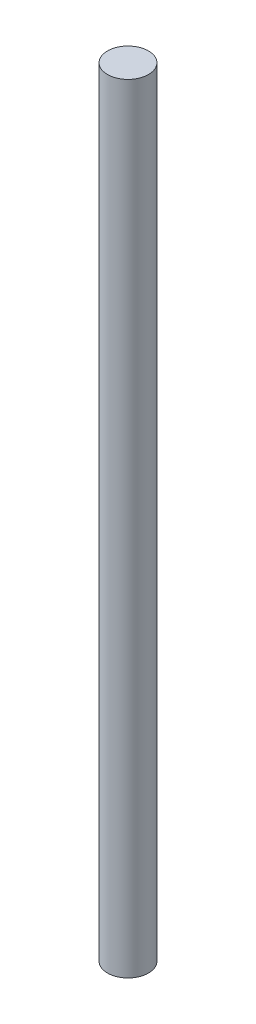
ISO-10303-21;
HEADER;
FILE_DESCRIPTION(('STEP AP214'),'2;1');
FILE_NAME('part.step','',(''),(''),'','','');
FILE_SCHEMA(('AUTOMOTIVE_DESIGN { 1 0 10303 214 1 1 1 1 }'));
ENDSEC;
DATA;
#1=APPLICATION_CONTEXT('core data for automotive mechanical design processes');
#2=APPLICATION_PROTOCOL_DEFINITION('international standard','automotive_design',2000,#1);
#3=PRODUCT_CONTEXT('',#1,'mechanical');
#4=PRODUCT('Part','Part','',(#3));
#5=PRODUCT_RELATED_PRODUCT_CATEGORY('part','',(#4));
#6=PRODUCT_DEFINITION_FORMATION('','',#4);
#7=PRODUCT_DEFINITION_CONTEXT('part definition',#1,'design');
#8=PRODUCT_DEFINITION('design','',#6,#7);
#9=PRODUCT_DEFINITION_SHAPE('','',#8);
#10=(LENGTH_UNIT() NAMED_UNIT(*) SI_UNIT(.MILLI.,.METRE.));
#11=(NAMED_UNIT(*) PLANE_ANGLE_UNIT() SI_UNIT($,.RADIAN.));
#12=(NAMED_UNIT(*) SI_UNIT($,.STERADIAN.) SOLID_ANGLE_UNIT());
#13=UNCERTAINTY_MEASURE_WITH_UNIT(LENGTH_MEASURE(1.E-05),#10,'distance_accuracy_value','');
#14=(GEOMETRIC_REPRESENTATION_CONTEXT(3) GLOBAL_UNCERTAINTY_ASSIGNED_CONTEXT((#13)) GLOBAL_UNIT_ASSIGNED_CONTEXT((#10,
#11,#12)) REPRESENTATION_CONTEXT('',''));
#15=CARTESIAN_POINT('',(0.,0.,0.));
#16=DIRECTION('',(0.,0.,1.));
#17=DIRECTION('',(1.,0.,0.));
#18=AXIS2_PLACEMENT_3D('',#15,#16,#17);
#19=CARTESIAN_POINT('',(0.,190.,0.));
#20=DIRECTION('',(0.,-1.,0.));
#21=DIRECTION('',(0.,0.,-1.));
#22=AXIS2_PLACEMENT_3D('',#19,#20,#21);
#23=CYLINDRICAL_SURFACE('',#22,5.);
#24=CARTESIAN_POINT('',(0.,190.,0.));
#25=DIRECTION('',(0.,1.,0.));
#26=DIRECTION('',(0.,0.,1.));
#27=AXIS2_PLACEMENT_3D('',#24,#25,#26);
#28=CIRCLE('',#27,5.);
#29=CARTESIAN_POINT('',(0.,190.,5.));
#30=VERTEX_POINT('',#29);
#31=EDGE_CURVE('E10',#30,#30,#28,.T.);
#32=ORIENTED_EDGE('',*,*,#31,.F.);
#33=EDGE_LOOP('',(#32));
#34=FACE_BOUND('',#33,.T.);
#35=CARTESIAN_POINT('',(0.,0.,0.));
#36=DIRECTION('',(0.,1.,0.));
#37=DIRECTION('',(0.,0.,1.));
#38=AXIS2_PLACEMENT_3D('',#35,#36,#37);
#39=CIRCLE('',#38,5.);
#40=CARTESIAN_POINT('',(0.,0.,5.));
#41=VERTEX_POINT('',#40);
#42=EDGE_CURVE('E40',#41,#41,#39,.T.);
#43=ORIENTED_EDGE('',*,*,#42,.T.);
#44=EDGE_LOOP('',(#43));
#45=FACE_BOUND('',#44,.T.);
#46=ADVANCED_FACE('F37',(#34,#45),#23,.T.);
#47=CARTESIAN_POINT('',(0.,190.,0.));
#48=DIRECTION('',(0.,1.,0.));
#49=DIRECTION('',(0.,0.,1.));
#50=AXIS2_PLACEMENT_3D('',#47,#48,#49);
#51=PLANE('',#50);
#52=ORIENTED_EDGE('',*,*,#31,.T.);
#53=EDGE_LOOP('',(#52));
#54=FACE_BOUND('',#53,.T.);
#55=ADVANCED_FACE('F54',(#54),#51,.T.);
#56=CARTESIAN_POINT('',(0.,0.,0.));
#57=DIRECTION('',(0.,1.,0.));
#58=DIRECTION('',(0.,0.,1.));
#59=AXIS2_PLACEMENT_3D('',#56,#57,#58);
#60=PLANE('',#59);
#61=ORIENTED_EDGE('',*,*,#42,.F.);
#62=EDGE_LOOP('',(#61));
#63=FACE_BOUND('',#62,.T.);
#64=ADVANCED_FACE('F52',(#63),#60,.F.);
#65=CLOSED_SHELL('',(#46,#55,#64));
#66=MANIFOLD_SOLID_BREP('B2',#65);
#67=ADVANCED_BREP_SHAPE_REPRESENTATION('',(#18,#66),#14);
#68=SHAPE_DEFINITION_REPRESENTATION(#9,#67);
ENDSEC;
END-ISO-10303-21;
